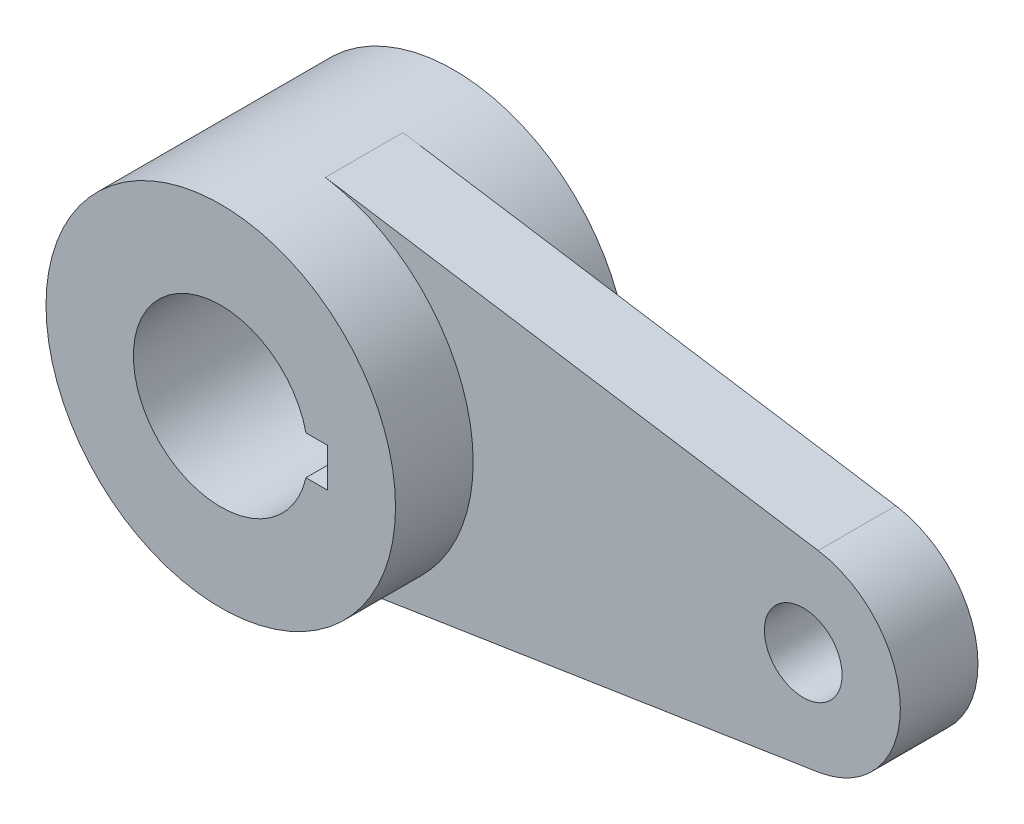
ISO-10303-21;
HEADER;
FILE_DESCRIPTION(('STEP AP214'),'2;1');
FILE_NAME('part.step','',(''),(''),'','','');
FILE_SCHEMA(('AUTOMOTIVE_DESIGN { 1 0 10303 214 1 1 1 1 }'));
ENDSEC;
DATA;
#1=APPLICATION_CONTEXT('core data for automotive mechanical design processes');
#2=APPLICATION_PROTOCOL_DEFINITION('international standard','automotive_design',2000,#1);
#3=PRODUCT_CONTEXT('',#1,'mechanical');
#4=PRODUCT('Part','Part','',(#3));
#5=PRODUCT_RELATED_PRODUCT_CATEGORY('part','',(#4));
#6=PRODUCT_DEFINITION_FORMATION('','',#4);
#7=PRODUCT_DEFINITION_CONTEXT('part definition',#1,'design');
#8=PRODUCT_DEFINITION('design','',#6,#7);
#9=PRODUCT_DEFINITION_SHAPE('','',#8);
#10=(LENGTH_UNIT() NAMED_UNIT(*) SI_UNIT(.MILLI.,.METRE.));
#11=(NAMED_UNIT(*) PLANE_ANGLE_UNIT() SI_UNIT($,.RADIAN.));
#12=(NAMED_UNIT(*) SI_UNIT($,.STERADIAN.) SOLID_ANGLE_UNIT());
#13=UNCERTAINTY_MEASURE_WITH_UNIT(LENGTH_MEASURE(1.E-05),#10,'distance_accuracy_value','');
#14=(GEOMETRIC_REPRESENTATION_CONTEXT(3) GLOBAL_UNCERTAINTY_ASSIGNED_CONTEXT((#13)) GLOBAL_UNIT_ASSIGNED_CONTEXT((#10,
#11,#12)) REPRESENTATION_CONTEXT('',''));
#15=CARTESIAN_POINT('',(0.,0.,0.));
#16=DIRECTION('',(0.,0.,1.));
#17=DIRECTION('',(1.,0.,0.));
#18=AXIS2_PLACEMENT_3D('',#15,#16,#17);
#19=CARTESIAN_POINT('',(4.39615384615385,-28.2348093027197,-6.35));
#20=DIRECTION('',(0.153846153846154,-0.988094813743472,0.));
#21=DIRECTION('',(0.988094813743472,0.153846153846154,0.));
#22=AXIS2_PLACEMENT_3D('',#19,#20,#21);
#23=PLANE('',#22);
#24=DIRECTION('',(0.,0.,1.));
#25=VECTOR('',#24,1.);
#26=CARTESIAN_POINT('',(84.9923076923077,-15.6860051681776,-6.35));
#27=LINE('',#26,#25);
#28=CARTESIAN_POINT('',(84.9923076923077,-15.6860051681776,-6.35));
#29=VERTEX_POINT('',#28);
#30=CARTESIAN_POINT('',(84.9923076923077,-15.6860051681776,6.35));
#31=VERTEX_POINT('',#30);
#32=EDGE_CURVE('E165',#29,#31,#27,.T.);
#33=ORIENTED_EDGE('',*,*,#32,.T.);
#34=DIRECTION('',(0.988094813743472,0.153846153846154,0.));
#35=VECTOR('',#34,1.);
#36=CARTESIAN_POINT('',(4.39615384615385,-28.2348093027197,6.35));
#37=LINE('',#36,#35);
#38=CARTESIAN_POINT('',(4.39615384615385,-28.2348093027197,6.35));
#39=VERTEX_POINT('',#38);
#40=EDGE_CURVE('E144',#39,#31,#37,.T.);
#41=ORIENTED_EDGE('',*,*,#40,.F.);
#42=DIRECTION('',(0.,0.,1.));
#43=VECTOR('',#42,1.);
#44=CARTESIAN_POINT('',(4.39615384615385,-28.2348093027197,-6.35));
#45=LINE('',#44,#43);
#46=CARTESIAN_POINT('',(4.39615384615385,-28.2348093027197,-6.35));
#47=VERTEX_POINT('',#46);
#48=EDGE_CURVE('E55',#47,#39,#45,.T.);
#49=ORIENTED_EDGE('',*,*,#48,.F.);
#50=DIRECTION('',(0.988094813743472,0.153846153846154,0.));
#51=VECTOR('',#50,1.);
#52=CARTESIAN_POINT('',(4.39615384615385,-28.2348093027197,-6.35));
#53=LINE('',#52,#51);
#54=EDGE_CURVE('E155',#47,#29,#53,.T.);
#55=ORIENTED_EDGE('',*,*,#54,.T.);
#56=EDGE_LOOP('',(#33,#41,#49,#55));
#57=FACE_BOUND('',#56,.T.);
#58=ADVANCED_FACE('F33',(#57),#23,.T.);
#59=CARTESIAN_POINT('',(4.39615384615385,28.2348093027197,-6.35));
#60=DIRECTION('',(0.153846153846154,0.988094813743472,0.));
#61=DIRECTION('',(-0.988094813743472,0.153846153846154,0.));
#62=AXIS2_PLACEMENT_3D('',#59,#60,#61);
#63=PLANE('',#62);
#64=DIRECTION('',(0.,0.,1.));
#65=VECTOR('',#64,1.);
#66=CARTESIAN_POINT('',(4.39615384615385,28.2348093027197,-6.35));
#67=LINE('',#66,#65);
#68=CARTESIAN_POINT('',(4.39615384615385,28.2348093027197,-6.35));
#69=VERTEX_POINT('',#68);
#70=CARTESIAN_POINT('',(4.39615384615385,28.2348093027197,6.35));
#71=VERTEX_POINT('',#70);
#72=EDGE_CURVE('E167',#69,#71,#67,.T.);
#73=ORIENTED_EDGE('',*,*,#72,.T.);
#74=DIRECTION('',(-0.988094813743472,0.153846153846154,0.));
#75=VECTOR('',#74,1.);
#76=CARTESIAN_POINT('',(4.39615384615385,28.2348093027197,6.35));
#77=LINE('',#76,#75);
#78=CARTESIAN_POINT('',(84.9923076923077,15.6860051681776,6.35));
#79=VERTEX_POINT('',#78);
#80=EDGE_CURVE('E150',#79,#71,#77,.T.);
#81=ORIENTED_EDGE('',*,*,#80,.F.);
#82=DIRECTION('',(0.,0.,1.));
#83=VECTOR('',#82,1.);
#84=CARTESIAN_POINT('',(84.9923076923077,15.6860051681776,-6.35));
#85=LINE('',#84,#83);
#86=CARTESIAN_POINT('',(84.9923076923077,15.6860051681776,-6.35));
#87=VERTEX_POINT('',#86);
#88=EDGE_CURVE('E170',#87,#79,#85,.T.);
#89=ORIENTED_EDGE('',*,*,#88,.F.);
#90=DIRECTION('',(-0.988094813743472,0.153846153846154,0.));
#91=VECTOR('',#90,1.);
#92=CARTESIAN_POINT('',(4.39615384615385,28.2348093027197,-6.35));
#93=LINE('',#92,#91);
#94=EDGE_CURVE('E160',#87,#69,#93,.T.);
#95=ORIENTED_EDGE('',*,*,#94,.T.);
#96=EDGE_LOOP('',(#73,#81,#89,#95));
#97=FACE_BOUND('',#96,.T.);
#98=ADVANCED_FACE('F192',(#97),#63,.T.);
#99=CARTESIAN_POINT('',(82.55,0.,-6.35));
#100=DIRECTION('',(0.,0.,1.));
#101=DIRECTION('',(1.,0.,0.));
#102=AXIS2_PLACEMENT_3D('',#99,#100,#101);
#103=CYLINDRICAL_SURFACE('',#102,15.875);
#104=ORIENTED_EDGE('',*,*,#88,.T.);
#105=CARTESIAN_POINT('',(82.55,0.,6.35));
#106=DIRECTION('',(0.,0.,1.));
#107=DIRECTION('',(1.,0.,0.));
#108=AXIS2_PLACEMENT_3D('',#105,#106,#107);
#109=CIRCLE('',#108,15.875);
#110=EDGE_CURVE('E147',#31,#79,#109,.T.);
#111=ORIENTED_EDGE('',*,*,#110,.F.);
#112=ORIENTED_EDGE('',*,*,#32,.F.);
#113=CARTESIAN_POINT('',(82.55,0.,-6.35));
#114=DIRECTION('',(0.,0.,1.));
#115=DIRECTION('',(1.,0.,0.));
#116=AXIS2_PLACEMENT_3D('',#113,#114,#115);
#117=CIRCLE('',#116,15.875);
#118=EDGE_CURVE('E157',#29,#87,#117,.T.);
#119=ORIENTED_EDGE('',*,*,#118,.T.);
#120=EDGE_LOOP('',(#104,#111,#112,#119));
#121=FACE_BOUND('',#120,.T.);
#122=ADVANCED_FACE('F196',(#121),#103,.T.);
#123=CARTESIAN_POINT('',(0.,0.,-6.35));
#124=DIRECTION('',(0.,0.,1.));
#125=DIRECTION('',(1.,0.,0.));
#126=AXIS2_PLACEMENT_3D('',#123,#124,#125);
#127=PLANE('',#126);
#128=CARTESIAN_POINT('',(82.55,0.,-6.35));
#129=DIRECTION('',(0.,0.,1.));
#130=DIRECTION('',(1.,0.,0.));
#131=AXIS2_PLACEMENT_3D('',#128,#129,#130);
#132=CIRCLE('',#131,6.35);
#133=CARTESIAN_POINT('',(88.9,0.,-6.35));
#134=VERTEX_POINT('',#133);
#135=EDGE_CURVE('E135',#134,#134,#132,.T.);
#136=ORIENTED_EDGE('',*,*,#135,.T.);
#137=EDGE_LOOP('',(#136));
#138=FACE_BOUND('',#137,.T.);
#139=ORIENTED_EDGE('',*,*,#54,.F.);
#140=CARTESIAN_POINT('',(0.,0.,-6.35));
#141=DIRECTION('',(0.,0.,1.));
#142=DIRECTION('',(1.,0.,0.));
#143=AXIS2_PLACEMENT_3D('',#140,#141,#142);
#144=CIRCLE('',#143,28.575);
#145=EDGE_CURVE('E163',#47,#69,#144,.T.);
#146=ORIENTED_EDGE('',*,*,#145,.T.);
#147=ORIENTED_EDGE('',*,*,#94,.F.);
#148=ORIENTED_EDGE('',*,*,#118,.F.);
#149=EDGE_LOOP('',(#139,#146,#147,#148));
#150=FACE_BOUND('',#149,.T.);
#151=ADVANCED_FACE('F212',(#138,#150),#127,.F.);
#152=CARTESIAN_POINT('',(0.,0.,6.35));
#153=DIRECTION('',(0.,0.,1.));
#154=DIRECTION('',(1.,0.,0.));
#155=AXIS2_PLACEMENT_3D('',#152,#153,#154);
#156=PLANE('',#155);
#157=CARTESIAN_POINT('',(82.55,0.,6.35));
#158=DIRECTION('',(0.,0.,1.));
#159=DIRECTION('',(1.,0.,0.));
#160=AXIS2_PLACEMENT_3D('',#157,#158,#159);
#161=CIRCLE('',#160,6.35);
#162=CARTESIAN_POINT('',(88.9,0.,6.35));
#163=VERTEX_POINT('',#162);
#164=EDGE_CURVE('E130',#163,#163,#161,.T.);
#165=ORIENTED_EDGE('',*,*,#164,.F.);
#166=EDGE_LOOP('',(#165));
#167=FACE_BOUND('',#166,.T.);
#168=ORIENTED_EDGE('',*,*,#40,.T.);
#169=ORIENTED_EDGE('',*,*,#110,.T.);
#170=ORIENTED_EDGE('',*,*,#80,.T.);
#171=CARTESIAN_POINT('',(0.,0.,6.35));
#172=DIRECTION('',(0.,0.,1.));
#173=DIRECTION('',(1.,0.,0.));
#174=AXIS2_PLACEMENT_3D('',#171,#172,#173);
#175=CIRCLE('',#174,28.575);
#176=EDGE_CURVE('E152',#39,#71,#175,.T.);
#177=ORIENTED_EDGE('',*,*,#176,.F.);
#178=EDGE_LOOP('',(#168,#169,#170,#177));
#179=FACE_BOUND('',#178,.T.);
#180=ADVANCED_FACE('F205',(#167,#179),#156,.T.);
#181=CARTESIAN_POINT('',(0.,0.,-19.05));
#182=DIRECTION('',(0.,0.,1.));
#183=DIRECTION('',(1.,0.,0.));
#184=AXIS2_PLACEMENT_3D('',#181,#182,#183);
#185=CYLINDRICAL_SURFACE('',#184,28.575);
#186=CARTESIAN_POINT('',(0.,0.,19.05));
#187=DIRECTION('',(0.,0.,1.));
#188=DIRECTION('',(1.,0.,0.));
#189=AXIS2_PLACEMENT_3D('',#186,#187,#188);
#190=CIRCLE('',#189,28.575);
#191=CARTESIAN_POINT('',(28.575,0.,19.05));
#192=VERTEX_POINT('',#191);
#193=EDGE_CURVE('E138',#192,#192,#190,.T.);
#194=ORIENTED_EDGE('',*,*,#193,.F.);
#195=EDGE_LOOP('',(#194));
#196=FACE_BOUND('',#195,.T.);
#197=CARTESIAN_POINT('',(0.,0.,-19.05));
#198=DIRECTION('',(0.,0.,1.));
#199=DIRECTION('',(1.,0.,0.));
#200=AXIS2_PLACEMENT_3D('',#197,#198,#199);
#201=CIRCLE('',#200,28.575);
#202=CARTESIAN_POINT('',(28.575,0.,-19.05));
#203=VERTEX_POINT('',#202);
#204=EDGE_CURVE('E141',#203,#203,#201,.T.);
#205=ORIENTED_EDGE('',*,*,#204,.T.);
#206=EDGE_LOOP('',(#205));
#207=FACE_BOUND('',#206,.T.);
#208=ORIENTED_EDGE('',*,*,#145,.F.);
#209=ORIENTED_EDGE('',*,*,#48,.T.);
#210=ORIENTED_EDGE('',*,*,#176,.T.);
#211=ORIENTED_EDGE('',*,*,#72,.F.);
#212=EDGE_LOOP('',(#208,#209,#210,#211));
#213=FACE_BOUND('',#212,.T.);
#214=ADVANCED_FACE('F209',(#196,#207,#213),#185,.T.);
#215=CARTESIAN_POINT('',(0.,0.,-19.05));
#216=DIRECTION('',(0.,0.,1.));
#217=DIRECTION('',(1.,0.,0.));
#218=AXIS2_PLACEMENT_3D('',#215,#216,#217);
#219=PLANE('',#218);
#220=DIRECTION('',(0.,1.,0.));
#221=VECTOR('',#220,1.);
#222=CARTESIAN_POINT('',(17.4752,3.175,-19.05));
#223=LINE('',#222,#221);
#224=CARTESIAN_POINT('',(17.4752,-3.175,-19.05));
#225=VERTEX_POINT('',#224);
#226=CARTESIAN_POINT('',(17.4752,3.175,-19.05));
#227=VERTEX_POINT('',#226);
#228=EDGE_CURVE('E108',#225,#227,#223,.T.);
#229=ORIENTED_EDGE('',*,*,#228,.T.);
#230=DIRECTION('',(-1.,0.,0.));
#231=VECTOR('',#230,1.);
#232=CARTESIAN_POINT('',(0.,3.175,-19.05));
#233=LINE('',#232,#231);
#234=CARTESIAN_POINT('',(13.930255964985,3.175,-19.05));
#235=VERTEX_POINT('',#234);
#236=EDGE_CURVE('E105',#227,#235,#233,.T.);
#237=ORIENTED_EDGE('',*,*,#236,.T.);
#238=CARTESIAN_POINT('',(0.,0.,-19.05));
#239=DIRECTION('',(0.,0.,1.));
#240=DIRECTION('',(1.,0.,0.));
#241=AXIS2_PLACEMENT_3D('',#238,#239,#240);
#242=CIRCLE('',#241,14.2875);
#243=CARTESIAN_POINT('',(13.930255964985,-3.175,-19.05));
#244=VERTEX_POINT('',#243);
#245=EDGE_CURVE('E118',#235,#244,#242,.T.);
#246=ORIENTED_EDGE('',*,*,#245,.T.);
#247=DIRECTION('',(1.,0.,0.));
#248=VECTOR('',#247,1.);
#249=CARTESIAN_POINT('',(0.,-3.175,-19.05));
#250=LINE('',#249,#248);
#251=EDGE_CURVE('E47',#244,#225,#250,.T.);
#252=ORIENTED_EDGE('',*,*,#251,.T.);
#253=EDGE_LOOP('',(#229,#237,#246,#252));
#254=FACE_BOUND('',#253,.T.);
#255=ORIENTED_EDGE('',*,*,#204,.F.);
#256=EDGE_LOOP('',(#255));
#257=FACE_BOUND('',#256,.T.);
#258=ADVANCED_FACE('F115',(#254,#257),#219,.F.);
#259=CARTESIAN_POINT('',(0.,0.,19.05));
#260=DIRECTION('',(0.,0.,1.));
#261=DIRECTION('',(1.,0.,0.));
#262=AXIS2_PLACEMENT_3D('',#259,#260,#261);
#263=PLANE('',#262);
#264=DIRECTION('',(-1.,0.,0.));
#265=VECTOR('',#264,1.);
#266=CARTESIAN_POINT('',(0.,3.175,19.05));
#267=LINE('',#266,#265);
#268=CARTESIAN_POINT('',(17.4752,3.175,19.05));
#269=VERTEX_POINT('',#268);
#270=CARTESIAN_POINT('',(13.930255964985,3.175,19.05));
#271=VERTEX_POINT('',#270);
#272=EDGE_CURVE('E119',#269,#271,#267,.T.);
#273=ORIENTED_EDGE('',*,*,#272,.F.);
#274=DIRECTION('',(0.,1.,0.));
#275=VECTOR('',#274,1.);
#276=CARTESIAN_POINT('',(17.4752,3.175,19.05));
#277=LINE('',#276,#275);
#278=CARTESIAN_POINT('',(17.4752,-3.175,19.05));
#279=VERTEX_POINT('',#278);
#280=EDGE_CURVE('E121',#279,#269,#277,.T.);
#281=ORIENTED_EDGE('',*,*,#280,.F.);
#282=DIRECTION('',(1.,0.,0.));
#283=VECTOR('',#282,1.);
#284=CARTESIAN_POINT('',(0.,-3.175,19.05));
#285=LINE('',#284,#283);
#286=CARTESIAN_POINT('',(13.930255964985,-3.175,19.05));
#287=VERTEX_POINT('',#286);
#288=EDGE_CURVE('E100',#287,#279,#285,.T.);
#289=ORIENTED_EDGE('',*,*,#288,.F.);
#290=CARTESIAN_POINT('',(0.,0.,19.05));
#291=DIRECTION('',(0.,0.,1.));
#292=DIRECTION('',(1.,0.,0.));
#293=AXIS2_PLACEMENT_3D('',#290,#291,#292);
#294=CIRCLE('',#293,14.2875);
#295=EDGE_CURVE('E127',#271,#287,#294,.T.);
#296=ORIENTED_EDGE('',*,*,#295,.F.);
#297=EDGE_LOOP('',(#273,#281,#289,#296));
#298=FACE_BOUND('',#297,.T.);
#299=ORIENTED_EDGE('',*,*,#193,.T.);
#300=EDGE_LOOP('',(#299));
#301=FACE_BOUND('',#300,.T.);
#302=ADVANCED_FACE('F177',(#298,#301),#263,.T.);
#303=CARTESIAN_POINT('',(82.55,0.,-19.05));
#304=DIRECTION('',(0.,0.,1.));
#305=DIRECTION('',(1.,0.,0.));
#306=AXIS2_PLACEMENT_3D('',#303,#304,#305);
#307=CYLINDRICAL_SURFACE('',#306,6.35);
#308=ORIENTED_EDGE('',*,*,#164,.T.);
#309=EDGE_LOOP('',(#308));
#310=FACE_BOUND('',#309,.T.);
#311=ORIENTED_EDGE('',*,*,#135,.F.);
#312=EDGE_LOOP('',(#311));
#313=FACE_BOUND('',#312,.T.);
#314=ADVANCED_FACE('F188',(#310,#313),#307,.F.);
#315=CARTESIAN_POINT('',(0.,0.,-19.05));
#316=DIRECTION('',(0.,0.,1.));
#317=DIRECTION('',(1.,0.,0.));
#318=AXIS2_PLACEMENT_3D('',#315,#316,#317);
#319=CYLINDRICAL_SURFACE('',#318,14.2875);
#320=ORIENTED_EDGE('',*,*,#245,.F.);
#321=DIRECTION('',(0.,0.,1.));
#322=VECTOR('',#321,1.);
#323=CARTESIAN_POINT('',(13.930255964985,3.175,-19.05));
#324=LINE('',#323,#322);
#325=EDGE_CURVE('E11',#235,#271,#324,.T.);
#326=ORIENTED_EDGE('',*,*,#325,.T.);
#327=ORIENTED_EDGE('',*,*,#295,.T.);
#328=DIRECTION('',(0.,0.,1.));
#329=VECTOR('',#328,1.);
#330=CARTESIAN_POINT('',(13.930255964985,-3.175,-19.05));
#331=LINE('',#330,#329);
#332=EDGE_CURVE('E40',#287,#244,#331,.F.);
#333=ORIENTED_EDGE('',*,*,#332,.T.);
#334=EDGE_LOOP('',(#320,#326,#327,#333));
#335=FACE_BOUND('',#334,.T.);
#336=ADVANCED_FACE('F173',(#335),#319,.F.);
#337=CARTESIAN_POINT('',(0.,3.175,-19.05));
#338=DIRECTION('',(0.,1.,0.));
#339=DIRECTION('',(0.,0.,1.));
#340=AXIS2_PLACEMENT_3D('',#337,#338,#339);
#341=PLANE('',#340);
#342=ORIENTED_EDGE('',*,*,#236,.F.);
#343=DIRECTION('',(0.,0.,1.));
#344=VECTOR('',#343,1.);
#345=CARTESIAN_POINT('',(17.4752,3.175,-19.05));
#346=LINE('',#345,#344);
#347=EDGE_CURVE('E104',#227,#269,#346,.T.);
#348=ORIENTED_EDGE('',*,*,#347,.T.);
#349=ORIENTED_EDGE('',*,*,#272,.T.);
#350=ORIENTED_EDGE('',*,*,#325,.F.);
#351=EDGE_LOOP('',(#342,#348,#349,#350));
#352=FACE_BOUND('',#351,.T.);
#353=ADVANCED_FACE('F180',(#352),#341,.F.);
#354=CARTESIAN_POINT('',(0.,-3.175,-19.05));
#355=DIRECTION('',(0.,-1.,0.));
#356=DIRECTION('',(0.,0.,-1.));
#357=AXIS2_PLACEMENT_3D('',#354,#355,#356);
#358=PLANE('',#357);
#359=ORIENTED_EDGE('',*,*,#288,.T.);
#360=DIRECTION('',(0.,0.,1.));
#361=VECTOR('',#360,1.);
#362=CARTESIAN_POINT('',(17.4752,-3.175,-19.05));
#363=LINE('',#362,#361);
#364=EDGE_CURVE('E96',#225,#279,#363,.T.);
#365=ORIENTED_EDGE('',*,*,#364,.F.);
#366=ORIENTED_EDGE('',*,*,#251,.F.);
#367=ORIENTED_EDGE('',*,*,#332,.F.);
#368=EDGE_LOOP('',(#359,#365,#366,#367));
#369=FACE_BOUND('',#368,.T.);
#370=ADVANCED_FACE('F98',(#369),#358,.F.);
#371=CARTESIAN_POINT('',(17.4752,3.175,-19.05));
#372=DIRECTION('',(1.,0.,0.));
#373=DIRECTION('',(0.,1.,0.));
#374=AXIS2_PLACEMENT_3D('',#371,#372,#373);
#375=PLANE('',#374);
#376=ORIENTED_EDGE('',*,*,#280,.T.);
#377=ORIENTED_EDGE('',*,*,#347,.F.);
#378=ORIENTED_EDGE('',*,*,#228,.F.);
#379=ORIENTED_EDGE('',*,*,#364,.T.);
#380=EDGE_LOOP('',(#376,#377,#378,#379));
#381=FACE_BOUND('',#380,.T.);
#382=ADVANCED_FACE('F109',(#381),#375,.F.);
#383=CLOSED_SHELL('',(#58,#98,#122,#151,#180,#214,#258,#302,#314,#336,#353,#370,#382));
#384=MANIFOLD_SOLID_BREP('B2',#383);
#385=ADVANCED_BREP_SHAPE_REPRESENTATION('',(#18,#384),#14);
#386=SHAPE_DEFINITION_REPRESENTATION(#9,#385);
ENDSEC;
END-ISO-10303-21;
